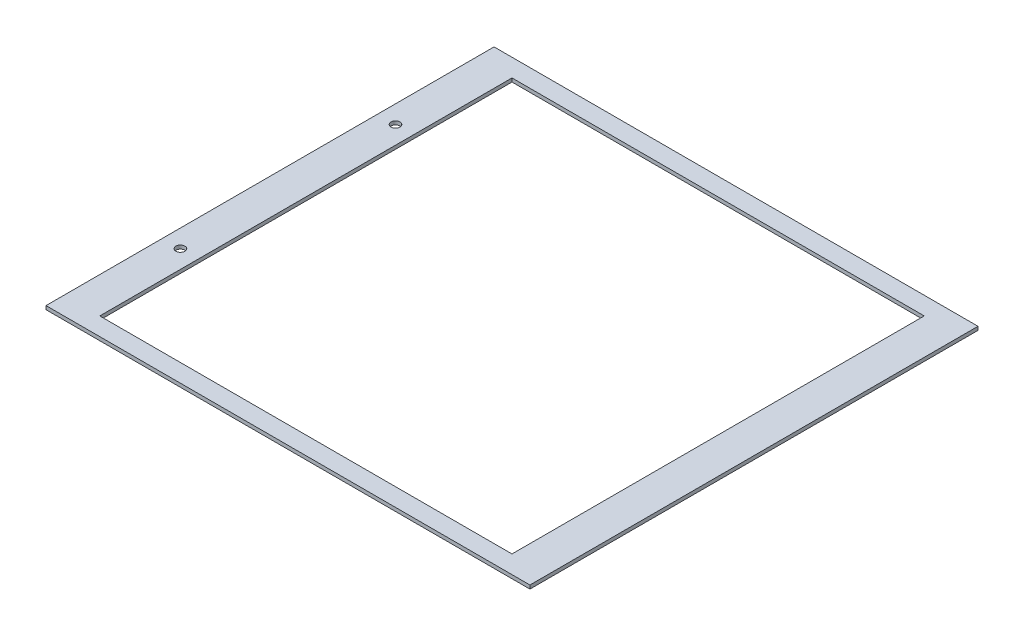
ISO-10303-21;
HEADER;
FILE_DESCRIPTION(('STEP AP214'),'2;1');
FILE_NAME('part.step','',(''),(''),'','','');
FILE_SCHEMA(('AUTOMOTIVE_DESIGN { 1 0 10303 214 1 1 1 1 }'));
ENDSEC;
DATA;
#1=APPLICATION_CONTEXT('core data for automotive mechanical design processes');
#2=APPLICATION_PROTOCOL_DEFINITION('international standard','automotive_design',2000,#1);
#3=PRODUCT_CONTEXT('',#1,'mechanical');
#4=PRODUCT('Part','Part','',(#3));
#5=PRODUCT_RELATED_PRODUCT_CATEGORY('part','',(#4));
#6=PRODUCT_DEFINITION_FORMATION('','',#4);
#7=PRODUCT_DEFINITION_CONTEXT('part definition',#1,'design');
#8=PRODUCT_DEFINITION('design','',#6,#7);
#9=PRODUCT_DEFINITION_SHAPE('','',#8);
#10=(LENGTH_UNIT() NAMED_UNIT(*) SI_UNIT(.MILLI.,.METRE.));
#11=(NAMED_UNIT(*) PLANE_ANGLE_UNIT() SI_UNIT($,.RADIAN.));
#12=(NAMED_UNIT(*) SI_UNIT($,.STERADIAN.) SOLID_ANGLE_UNIT());
#13=UNCERTAINTY_MEASURE_WITH_UNIT(LENGTH_MEASURE(1.E-05),#10,'distance_accuracy_value','');
#14=(GEOMETRIC_REPRESENTATION_CONTEXT(3) GLOBAL_UNCERTAINTY_ASSIGNED_CONTEXT((#13)) GLOBAL_UNIT_ASSIGNED_CONTEXT((#10,
#11,#12)) REPRESENTATION_CONTEXT('',''));
#15=CARTESIAN_POINT('',(0.,0.,0.));
#16=DIRECTION('',(0.,0.,1.));
#17=DIRECTION('',(1.,0.,0.));
#18=AXIS2_PLACEMENT_3D('',#15,#16,#17);
#19=CARTESIAN_POINT('',(0.,2.,0.));
#20=DIRECTION('',(0.,-1.,0.));
#21=DIRECTION('',(0.,0.,-1.));
#22=AXIS2_PLACEMENT_3D('',#19,#20,#21);
#23=PLANE('',#22);
#24=CARTESIAN_POINT('',(-125.,2.,60.0000000000001));
#25=DIRECTION('',(0.,1.,0.));
#26=DIRECTION('',(0.,0.,1.));
#27=AXIS2_PLACEMENT_3D('',#24,#25,#26);
#28=CIRCLE('',#27,2.5);
#29=CARTESIAN_POINT('',(-125.,2.,62.5000000000001));
#30=VERTEX_POINT('',#29);
#31=EDGE_CURVE('E232',#30,#30,#28,.T.);
#32=ORIENTED_EDGE('',*,*,#31,.F.);
#33=EDGE_LOOP('',(#32));
#34=FACE_BOUND('',#33,.T.);
#35=CARTESIAN_POINT('',(-125.,2.,-59.9999999999999));
#36=DIRECTION('',(0.,1.,0.));
#37=DIRECTION('',(0.,0.,1.));
#38=AXIS2_PLACEMENT_3D('',#35,#36,#37);
#39=CIRCLE('',#38,2.5);
#40=CARTESIAN_POINT('',(-125.,2.,-57.4999999999999));
#41=VERTEX_POINT('',#40);
#42=EDGE_CURVE('E234',#41,#41,#39,.T.);
#43=ORIENTED_EDGE('',*,*,#42,.F.);
#44=EDGE_LOOP('',(#43));
#45=FACE_BOUND('',#44,.T.);
#46=DIRECTION('',(-1.,0.,0.));
#47=VECTOR('',#46,1.);
#48=CARTESIAN_POINT('',(135.,2.,-125.));
#49=LINE('',#48,#47);
#50=CARTESIAN_POINT('',(135.,2.,-125.));
#51=VERTEX_POINT('',#50);
#52=CARTESIAN_POINT('',(-135.,2.,-125.));
#53=VERTEX_POINT('',#52);
#54=EDGE_CURVE('E138',#51,#53,#49,.T.);
#55=ORIENTED_EDGE('',*,*,#54,.T.);
#56=DIRECTION('',(0.,0.,1.));
#57=VECTOR('',#56,1.);
#58=CARTESIAN_POINT('',(-135.,2.,125.));
#59=LINE('',#58,#57);
#60=CARTESIAN_POINT('',(-135.,2.,125.));
#61=VERTEX_POINT('',#60);
#62=EDGE_CURVE('E141',#53,#61,#59,.T.);
#63=ORIENTED_EDGE('',*,*,#62,.T.);
#64=DIRECTION('',(1.,0.,0.));
#65=VECTOR('',#64,1.);
#66=CARTESIAN_POINT('',(135.,2.,125.));
#67=LINE('',#66,#65);
#68=CARTESIAN_POINT('',(135.,2.,125.));
#69=VERTEX_POINT('',#68);
#70=EDGE_CURVE('E144',#61,#69,#67,.T.);
#71=ORIENTED_EDGE('',*,*,#70,.T.);
#72=DIRECTION('',(0.,0.,-1.));
#73=VECTOR('',#72,1.);
#74=CARTESIAN_POINT('',(135.,2.,125.));
#75=LINE('',#74,#73);
#76=EDGE_CURVE('E146',#69,#51,#75,.T.);
#77=ORIENTED_EDGE('',*,*,#76,.T.);
#78=EDGE_LOOP('',(#55,#63,#71,#77));
#79=FACE_BOUND('',#78,.T.);
#80=DIRECTION('',(0.,0.,-1.));
#81=VECTOR('',#80,1.);
#82=CARTESIAN_POINT('',(115.,2.,-115.));
#83=LINE('',#82,#81);
#84=CARTESIAN_POINT('',(115.,2.,115.));
#85=VERTEX_POINT('',#84);
#86=CARTESIAN_POINT('',(115.,2.,-115.));
#87=VERTEX_POINT('',#86);
#88=EDGE_CURVE('E100',#85,#87,#83,.T.);
#89=ORIENTED_EDGE('',*,*,#88,.F.);
#90=DIRECTION('',(1.,0.,0.));
#91=VECTOR('',#90,1.);
#92=CARTESIAN_POINT('',(-115.,2.,115.));
#93=LINE('',#92,#91);
#94=CARTESIAN_POINT('',(-115.,2.,115.));
#95=VERTEX_POINT('',#94);
#96=EDGE_CURVE('E122',#95,#85,#93,.T.);
#97=ORIENTED_EDGE('',*,*,#96,.F.);
#98=DIRECTION('',(0.,0.,1.));
#99=VECTOR('',#98,1.);
#100=CARTESIAN_POINT('',(-115.,2.,-115.));
#101=LINE('',#100,#99);
#102=CARTESIAN_POINT('',(-115.,2.,-115.));
#103=VERTEX_POINT('',#102);
#104=EDGE_CURVE('E120',#103,#95,#101,.T.);
#105=ORIENTED_EDGE('',*,*,#104,.F.);
#106=DIRECTION('',(-1.,0.,0.));
#107=VECTOR('',#106,1.);
#108=CARTESIAN_POINT('',(-115.,2.,-115.));
#109=LINE('',#108,#107);
#110=EDGE_CURVE('E108',#87,#103,#109,.T.);
#111=ORIENTED_EDGE('',*,*,#110,.F.);
#112=EDGE_LOOP('',(#89,#97,#105,#111));
#113=FACE_BOUND('',#112,.T.);
#114=ADVANCED_FACE('F35',(#34,#45,#79,#113),#23,.F.);
#115=CARTESIAN_POINT('',(0.,0.,0.));
#116=DIRECTION('',(0.,-1.,0.));
#117=DIRECTION('',(0.,0.,-1.));
#118=AXIS2_PLACEMENT_3D('',#115,#116,#117);
#119=PLANE('',#118);
#120=CARTESIAN_POINT('',(-125.,0.,60.0000000000001));
#121=DIRECTION('',(0.,1.,0.));
#122=DIRECTION('',(0.,0.,1.));
#123=AXIS2_PLACEMENT_3D('',#120,#121,#122);
#124=CIRCLE('',#123,2.5);
#125=CARTESIAN_POINT('',(-125.,0.,62.5000000000001));
#126=VERTEX_POINT('',#125);
#127=EDGE_CURVE('E230',#126,#126,#124,.T.);
#128=ORIENTED_EDGE('',*,*,#127,.T.);
#129=EDGE_LOOP('',(#128));
#130=FACE_BOUND('',#129,.T.);
#131=CARTESIAN_POINT('',(-125.,0.,-59.9999999999999));
#132=DIRECTION('',(0.,1.,0.));
#133=DIRECTION('',(0.,0.,1.));
#134=AXIS2_PLACEMENT_3D('',#131,#132,#133);
#135=CIRCLE('',#134,2.5);
#136=CARTESIAN_POINT('',(-125.,0.,-57.4999999999999));
#137=VERTEX_POINT('',#136);
#138=EDGE_CURVE('E128',#137,#137,#135,.T.);
#139=ORIENTED_EDGE('',*,*,#138,.T.);
#140=EDGE_LOOP('',(#139));
#141=FACE_BOUND('',#140,.T.);
#142=DIRECTION('',(-1.,0.,0.));
#143=VECTOR('',#142,1.);
#144=CARTESIAN_POINT('',(135.,0.,-125.));
#145=LINE('',#144,#143);
#146=CARTESIAN_POINT('',(135.,0.,-125.));
#147=VERTEX_POINT('',#146);
#148=CARTESIAN_POINT('',(-135.,0.,-125.));
#149=VERTEX_POINT('',#148);
#150=EDGE_CURVE('E116',#147,#149,#145,.T.);
#151=ORIENTED_EDGE('',*,*,#150,.F.);
#152=DIRECTION('',(0.,0.,-1.));
#153=VECTOR('',#152,1.);
#154=CARTESIAN_POINT('',(135.,0.,125.));
#155=LINE('',#154,#153);
#156=CARTESIAN_POINT('',(135.,0.,125.));
#157=VERTEX_POINT('',#156);
#158=EDGE_CURVE('E142',#157,#147,#155,.T.);
#159=ORIENTED_EDGE('',*,*,#158,.F.);
#160=DIRECTION('',(1.,0.,0.));
#161=VECTOR('',#160,1.);
#162=CARTESIAN_POINT('',(135.,0.,125.));
#163=LINE('',#162,#161);
#164=CARTESIAN_POINT('',(-135.,0.,125.));
#165=VERTEX_POINT('',#164);
#166=EDGE_CURVE('E153',#165,#157,#163,.T.);
#167=ORIENTED_EDGE('',*,*,#166,.F.);
#168=DIRECTION('',(0.,0.,1.));
#169=VECTOR('',#168,1.);
#170=CARTESIAN_POINT('',(-135.,0.,125.));
#171=LINE('',#170,#169);
#172=EDGE_CURVE('E151',#149,#165,#171,.T.);
#173=ORIENTED_EDGE('',*,*,#172,.F.);
#174=EDGE_LOOP('',(#151,#159,#167,#173));
#175=FACE_BOUND('',#174,.T.);
#176=DIRECTION('',(1.,0.,0.));
#177=VECTOR('',#176,1.);
#178=CARTESIAN_POINT('',(-115.,0.,115.));
#179=LINE('',#178,#177);
#180=CARTESIAN_POINT('',(-115.,0.,115.));
#181=VERTEX_POINT('',#180);
#182=CARTESIAN_POINT('',(115.,0.,115.));
#183=VERTEX_POINT('',#182);
#184=EDGE_CURVE('E109',#181,#183,#179,.T.);
#185=ORIENTED_EDGE('',*,*,#184,.T.);
#186=DIRECTION('',(0.,0.,-1.));
#187=VECTOR('',#186,1.);
#188=CARTESIAN_POINT('',(115.,0.,-115.));
#189=LINE('',#188,#187);
#190=CARTESIAN_POINT('',(115.,0.,-115.));
#191=VERTEX_POINT('',#190);
#192=EDGE_CURVE('E58',#183,#191,#189,.T.);
#193=ORIENTED_EDGE('',*,*,#192,.T.);
#194=DIRECTION('',(-1.,0.,0.));
#195=VECTOR('',#194,1.);
#196=CARTESIAN_POINT('',(-115.,0.,-115.));
#197=LINE('',#196,#195);
#198=CARTESIAN_POINT('',(-115.,0.,-115.));
#199=VERTEX_POINT('',#198);
#200=EDGE_CURVE('E115',#191,#199,#197,.T.);
#201=ORIENTED_EDGE('',*,*,#200,.T.);
#202=DIRECTION('',(0.,0.,1.));
#203=VECTOR('',#202,1.);
#204=CARTESIAN_POINT('',(-115.,0.,-115.));
#205=LINE('',#204,#203);
#206=EDGE_CURVE('E130',#199,#181,#205,.T.);
#207=ORIENTED_EDGE('',*,*,#206,.T.);
#208=EDGE_LOOP('',(#185,#193,#201,#207));
#209=FACE_BOUND('',#208,.T.);
#210=ADVANCED_FACE('F171',(#130,#141,#175,#209),#119,.T.);
#211=CARTESIAN_POINT('',(135.,2.,-125.));
#212=DIRECTION('',(0.,0.,1.));
#213=DIRECTION('',(1.,0.,0.));
#214=AXIS2_PLACEMENT_3D('',#211,#212,#213);
#215=PLANE('',#214);
#216=ORIENTED_EDGE('',*,*,#150,.T.);
#217=DIRECTION('',(0.,-1.,0.));
#218=VECTOR('',#217,1.);
#219=CARTESIAN_POINT('',(-135.,2.,-125.));
#220=LINE('',#219,#218);
#221=EDGE_CURVE('E11',#53,#149,#220,.T.);
#222=ORIENTED_EDGE('',*,*,#221,.F.);
#223=ORIENTED_EDGE('',*,*,#54,.F.);
#224=DIRECTION('',(0.,-1.,0.));
#225=VECTOR('',#224,1.);
#226=CARTESIAN_POINT('',(135.,2.,-125.));
#227=LINE('',#226,#225);
#228=EDGE_CURVE('E148',#51,#147,#227,.T.);
#229=ORIENTED_EDGE('',*,*,#228,.T.);
#230=EDGE_LOOP('',(#216,#222,#223,#229));
#231=FACE_BOUND('',#230,.T.);
#232=ADVANCED_FACE('F37',(#231),#215,.F.);
#233=CARTESIAN_POINT('',(-135.,2.,125.));
#234=DIRECTION('',(1.,0.,0.));
#235=DIRECTION('',(0.,0.,-1.));
#236=AXIS2_PLACEMENT_3D('',#233,#234,#235);
#237=PLANE('',#236);
#238=ORIENTED_EDGE('',*,*,#172,.T.);
#239=DIRECTION('',(0.,-1.,0.));
#240=VECTOR('',#239,1.);
#241=CARTESIAN_POINT('',(-135.,2.,125.));
#242=LINE('',#241,#240);
#243=EDGE_CURVE('E43',#61,#165,#242,.T.);
#244=ORIENTED_EDGE('',*,*,#243,.F.);
#245=ORIENTED_EDGE('',*,*,#62,.F.);
#246=ORIENTED_EDGE('',*,*,#221,.T.);
#247=EDGE_LOOP('',(#238,#244,#245,#246));
#248=FACE_BOUND('',#247,.T.);
#249=ADVANCED_FACE('F181',(#248),#237,.F.);
#250=CARTESIAN_POINT('',(135.,2.,125.));
#251=DIRECTION('',(0.,0.,-1.));
#252=DIRECTION('',(-1.,0.,0.));
#253=AXIS2_PLACEMENT_3D('',#250,#251,#252);
#254=PLANE('',#253);
#255=ORIENTED_EDGE('',*,*,#166,.T.);
#256=DIRECTION('',(0.,-1.,0.));
#257=VECTOR('',#256,1.);
#258=CARTESIAN_POINT('',(135.,2.,125.));
#259=LINE('',#258,#257);
#260=EDGE_CURVE('E158',#69,#157,#259,.T.);
#261=ORIENTED_EDGE('',*,*,#260,.F.);
#262=ORIENTED_EDGE('',*,*,#70,.F.);
#263=ORIENTED_EDGE('',*,*,#243,.T.);
#264=EDGE_LOOP('',(#255,#261,#262,#263));
#265=FACE_BOUND('',#264,.T.);
#266=ADVANCED_FACE('F165',(#265),#254,.F.);
#267=CARTESIAN_POINT('',(135.,2.,125.));
#268=DIRECTION('',(-1.,0.,0.));
#269=DIRECTION('',(0.,0.,1.));
#270=AXIS2_PLACEMENT_3D('',#267,#268,#269);
#271=PLANE('',#270);
#272=ORIENTED_EDGE('',*,*,#158,.T.);
#273=ORIENTED_EDGE('',*,*,#228,.F.);
#274=ORIENTED_EDGE('',*,*,#76,.F.);
#275=ORIENTED_EDGE('',*,*,#260,.T.);
#276=EDGE_LOOP('',(#272,#273,#274,#275));
#277=FACE_BOUND('',#276,.T.);
#278=ADVANCED_FACE('F175',(#277),#271,.F.);
#279=CARTESIAN_POINT('',(115.,2.,-115.));
#280=DIRECTION('',(-1.,0.,0.));
#281=DIRECTION('',(0.,0.,1.));
#282=AXIS2_PLACEMENT_3D('',#279,#280,#281);
#283=PLANE('',#282);
#284=ORIENTED_EDGE('',*,*,#192,.F.);
#285=DIRECTION('',(0.,-1.,0.));
#286=VECTOR('',#285,1.);
#287=CARTESIAN_POINT('',(115.,2.,115.));
#288=LINE('',#287,#286);
#289=EDGE_CURVE('E104',#85,#183,#288,.T.);
#290=ORIENTED_EDGE('',*,*,#289,.F.);
#291=ORIENTED_EDGE('',*,*,#88,.T.);
#292=DIRECTION('',(0.,-1.,0.));
#293=VECTOR('',#292,1.);
#294=CARTESIAN_POINT('',(115.,2.,-115.));
#295=LINE('',#294,#293);
#296=EDGE_CURVE('E103',#87,#191,#295,.T.);
#297=ORIENTED_EDGE('',*,*,#296,.T.);
#298=EDGE_LOOP('',(#284,#290,#291,#297));
#299=FACE_BOUND('',#298,.T.);
#300=ADVANCED_FACE('F102',(#299),#283,.T.);
#301=CARTESIAN_POINT('',(-115.,2.,-115.));
#302=DIRECTION('',(0.,0.,1.));
#303=DIRECTION('',(1.,0.,0.));
#304=AXIS2_PLACEMENT_3D('',#301,#302,#303);
#305=PLANE('',#304);
#306=ORIENTED_EDGE('',*,*,#200,.F.);
#307=ORIENTED_EDGE('',*,*,#296,.F.);
#308=ORIENTED_EDGE('',*,*,#110,.T.);
#309=DIRECTION('',(0.,-1.,0.));
#310=VECTOR('',#309,1.);
#311=CARTESIAN_POINT('',(-115.,2.,-115.));
#312=LINE('',#311,#310);
#313=EDGE_CURVE('E117',#103,#199,#312,.T.);
#314=ORIENTED_EDGE('',*,*,#313,.T.);
#315=EDGE_LOOP('',(#306,#307,#308,#314));
#316=FACE_BOUND('',#315,.T.);
#317=ADVANCED_FACE('F112',(#316),#305,.T.);
#318=CARTESIAN_POINT('',(-115.,2.,-115.));
#319=DIRECTION('',(1.,0.,0.));
#320=DIRECTION('',(0.,0.,-1.));
#321=AXIS2_PLACEMENT_3D('',#318,#319,#320);
#322=PLANE('',#321);
#323=ORIENTED_EDGE('',*,*,#206,.F.);
#324=ORIENTED_EDGE('',*,*,#313,.F.);
#325=ORIENTED_EDGE('',*,*,#104,.T.);
#326=DIRECTION('',(0.,-1.,0.));
#327=VECTOR('',#326,1.);
#328=CARTESIAN_POINT('',(-115.,2.,115.));
#329=LINE('',#328,#327);
#330=EDGE_CURVE('E50',#95,#181,#329,.T.);
#331=ORIENTED_EDGE('',*,*,#330,.T.);
#332=EDGE_LOOP('',(#323,#324,#325,#331));
#333=FACE_BOUND('',#332,.T.);
#334=ADVANCED_FACE('F208',(#333),#322,.T.);
#335=CARTESIAN_POINT('',(-115.,2.,115.));
#336=DIRECTION('',(0.,0.,-1.));
#337=DIRECTION('',(-1.,0.,0.));
#338=AXIS2_PLACEMENT_3D('',#335,#336,#337);
#339=PLANE('',#338);
#340=ORIENTED_EDGE('',*,*,#184,.F.);
#341=ORIENTED_EDGE('',*,*,#330,.F.);
#342=ORIENTED_EDGE('',*,*,#96,.T.);
#343=ORIENTED_EDGE('',*,*,#289,.T.);
#344=EDGE_LOOP('',(#340,#341,#342,#343));
#345=FACE_BOUND('',#344,.T.);
#346=ADVANCED_FACE('F212',(#345),#339,.T.);
#347=CARTESIAN_POINT('',(-125.,0.,-59.9999999999999));
#348=DIRECTION('',(0.,1.,0.));
#349=DIRECTION('',(0.,0.,1.));
#350=AXIS2_PLACEMENT_3D('',#347,#348,#349);
#351=CYLINDRICAL_SURFACE('',#350,2.5);
#352=ORIENTED_EDGE('',*,*,#138,.F.);
#353=EDGE_LOOP('',(#352));
#354=FACE_BOUND('',#353,.T.);
#355=ORIENTED_EDGE('',*,*,#42,.T.);
#356=EDGE_LOOP('',(#355));
#357=FACE_BOUND('',#356,.T.);
#358=ADVANCED_FACE('F218',(#354,#357),#351,.F.);
#359=CARTESIAN_POINT('',(-125.,0.,60.0000000000001));
#360=DIRECTION('',(0.,1.,0.));
#361=DIRECTION('',(0.,0.,1.));
#362=AXIS2_PLACEMENT_3D('',#359,#360,#361);
#363=CYLINDRICAL_SURFACE('',#362,2.5);
#364=ORIENTED_EDGE('',*,*,#127,.F.);
#365=EDGE_LOOP('',(#364));
#366=FACE_BOUND('',#365,.T.);
#367=ORIENTED_EDGE('',*,*,#31,.T.);
#368=EDGE_LOOP('',(#367));
#369=FACE_BOUND('',#368,.T.);
#370=ADVANCED_FACE('F221',(#366,#369),#363,.F.);
#371=CLOSED_SHELL('',(#114,#210,#232,#249,#266,#278,#300,#317,#334,#346,#358,#370));
#372=MANIFOLD_SOLID_BREP('B2',#371);
#373=ADVANCED_BREP_SHAPE_REPRESENTATION('',(#18,#372),#14);
#374=SHAPE_DEFINITION_REPRESENTATION(#9,#373);
ENDSEC;
END-ISO-10303-21;
